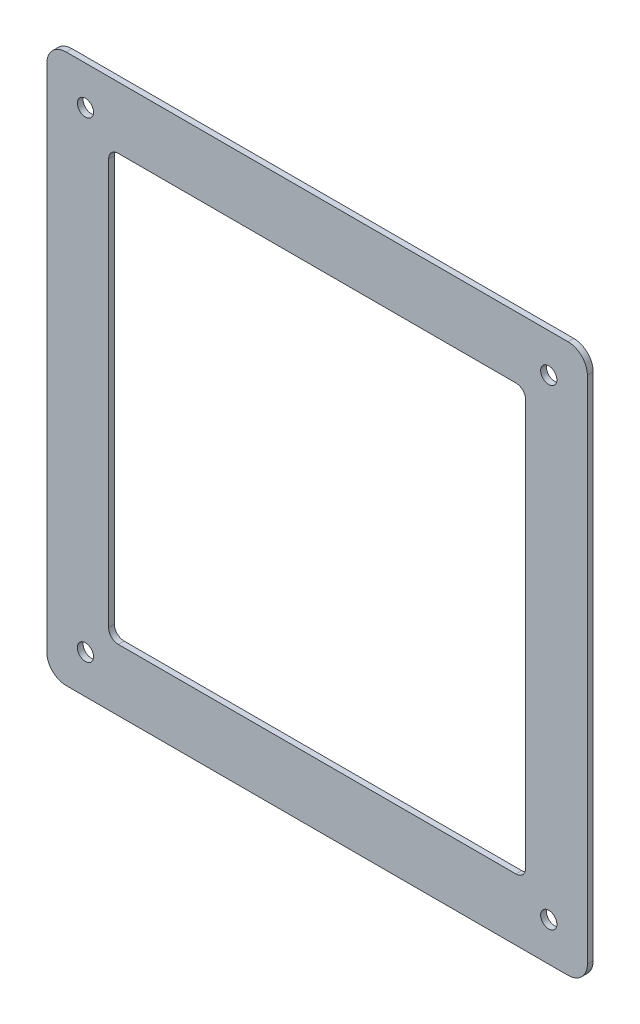
ISO-10303-21;
HEADER;
FILE_DESCRIPTION(('STEP AP214'),'2;1');
FILE_NAME('part.step','',(''),(''),'','','');
FILE_SCHEMA(('AUTOMOTIVE_DESIGN { 1 0 10303 214 1 1 1 1 }'));
ENDSEC;
DATA;
#1=APPLICATION_CONTEXT('core data for automotive mechanical design processes');
#2=APPLICATION_PROTOCOL_DEFINITION('international standard','automotive_design',2000,#1);
#3=PRODUCT_CONTEXT('',#1,'mechanical');
#4=PRODUCT('Part','Part','',(#3));
#5=PRODUCT_RELATED_PRODUCT_CATEGORY('part','',(#4));
#6=PRODUCT_DEFINITION_FORMATION('','',#4);
#7=PRODUCT_DEFINITION_CONTEXT('part definition',#1,'design');
#8=PRODUCT_DEFINITION('design','',#6,#7);
#9=PRODUCT_DEFINITION_SHAPE('','',#8);
#10=(LENGTH_UNIT() NAMED_UNIT(*) SI_UNIT(.MILLI.,.METRE.));
#11=(NAMED_UNIT(*) PLANE_ANGLE_UNIT() SI_UNIT($,.RADIAN.));
#12=(NAMED_UNIT(*) SI_UNIT($,.STERADIAN.) SOLID_ANGLE_UNIT());
#13=UNCERTAINTY_MEASURE_WITH_UNIT(LENGTH_MEASURE(1.E-05),#10,'distance_accuracy_value','');
#14=(GEOMETRIC_REPRESENTATION_CONTEXT(3) GLOBAL_UNCERTAINTY_ASSIGNED_CONTEXT((#13)) GLOBAL_UNIT_ASSIGNED_CONTEXT((#10,
#11,#12)) REPRESENTATION_CONTEXT('',''));
#15=CARTESIAN_POINT('',(0.,0.,0.));
#16=DIRECTION('',(0.,0.,1.));
#17=DIRECTION('',(1.,0.,0.));
#18=AXIS2_PLACEMENT_3D('',#15,#16,#17);
#19=CARTESIAN_POINT('',(0.,0.,3.));
#20=DIRECTION('',(0.,0.,-1.));
#21=DIRECTION('',(-1.,0.,0.));
#22=AXIS2_PLACEMENT_3D('',#19,#20,#21);
#23=PLANE('',#22);
#24=CARTESIAN_POINT('',(120.,-122.125,3.));
#25=DIRECTION('',(0.,0.,1.));
#26=DIRECTION('',(1.,0.,0.));
#27=AXIS2_PLACEMENT_3D('',#24,#25,#26);
#28=CIRCLE('',#27,4.2);
#29=CARTESIAN_POINT('',(124.2,-122.125,3.));
#30=VERTEX_POINT('',#29);
#31=EDGE_CURVE('E484',#30,#30,#28,.T.);
#32=ORIENTED_EDGE('',*,*,#31,.F.);
#33=EDGE_LOOP('',(#32));
#34=FACE_BOUND('',#33,.T.);
#35=CARTESIAN_POINT('',(-120.,122.125,3.));
#36=DIRECTION('',(0.,0.,1.));
#37=DIRECTION('',(1.,0.,0.));
#38=AXIS2_PLACEMENT_3D('',#35,#36,#37);
#39=CIRCLE('',#38,4.2);
#40=CARTESIAN_POINT('',(-115.8,122.125,3.));
#41=VERTEX_POINT('',#40);
#42=EDGE_CURVE('E486',#41,#41,#39,.T.);
#43=ORIENTED_EDGE('',*,*,#42,.F.);
#44=EDGE_LOOP('',(#43));
#45=FACE_BOUND('',#44,.T.);
#46=CARTESIAN_POINT('',(-120.,-122.125,3.));
#47=DIRECTION('',(0.,0.,1.));
#48=DIRECTION('',(1.,0.,0.));
#49=AXIS2_PLACEMENT_3D('',#46,#47,#48);
#50=CIRCLE('',#49,4.2);
#51=CARTESIAN_POINT('',(-115.8,-122.125,3.));
#52=VERTEX_POINT('',#51);
#53=EDGE_CURVE('E494',#52,#52,#50,.T.);
#54=ORIENTED_EDGE('',*,*,#53,.F.);
#55=EDGE_LOOP('',(#54));
#56=FACE_BOUND('',#55,.T.);
#57=CARTESIAN_POINT('',(120.,122.125,3.));
#58=DIRECTION('',(0.,0.,1.));
#59=DIRECTION('',(1.,0.,0.));
#60=AXIS2_PLACEMENT_3D('',#57,#58,#59);
#61=CIRCLE('',#60,4.2);
#62=CARTESIAN_POINT('',(124.2,122.125,3.));
#63=VERTEX_POINT('',#62);
#64=EDGE_CURVE('E499',#63,#63,#61,.T.);
#65=ORIENTED_EDGE('',*,*,#64,.F.);
#66=EDGE_LOOP('',(#65));
#67=FACE_BOUND('',#66,.T.);
#68=DIRECTION('',(0.,1.,0.));
#69=VECTOR('',#68,1.);
#70=CARTESIAN_POINT('',(140.,-142.125,3.));
#71=LINE('',#70,#69);
#72=CARTESIAN_POINT('',(140.,-132.125,3.));
#73=VERTEX_POINT('',#72);
#74=CARTESIAN_POINT('',(140.,132.125,3.));
#75=VERTEX_POINT('',#74);
#76=EDGE_CURVE('E186',#73,#75,#71,.T.);
#77=ORIENTED_EDGE('',*,*,#76,.T.);
#78=CARTESIAN_POINT('',(130.,132.125,3.));
#79=DIRECTION('',(0.,0.,-1.));
#80=DIRECTION('',(-1.,0.,0.));
#81=AXIS2_PLACEMENT_3D('',#78,#79,#80);
#82=CIRCLE('',#81,10.);
#83=CARTESIAN_POINT('',(130.,142.125,3.));
#84=VERTEX_POINT('',#83);
#85=EDGE_CURVE('E202',#75,#84,#82,.F.);
#86=ORIENTED_EDGE('',*,*,#85,.T.);
#87=DIRECTION('',(-1.,0.,0.));
#88=VECTOR('',#87,1.);
#89=CARTESIAN_POINT('',(-140.,142.125,3.));
#90=LINE('',#89,#88);
#91=CARTESIAN_POINT('',(-130.,142.125,3.));
#92=VERTEX_POINT('',#91);
#93=EDGE_CURVE('E167',#84,#92,#90,.T.);
#94=ORIENTED_EDGE('',*,*,#93,.T.);
#95=CARTESIAN_POINT('',(-130.,132.125,3.));
#96=DIRECTION('',(0.,0.,-1.));
#97=DIRECTION('',(-1.,0.,0.));
#98=AXIS2_PLACEMENT_3D('',#95,#96,#97);
#99=CIRCLE('',#98,10.);
#100=CARTESIAN_POINT('',(-140.,132.125,3.));
#101=VERTEX_POINT('',#100);
#102=EDGE_CURVE('E196',#92,#101,#99,.F.);
#103=ORIENTED_EDGE('',*,*,#102,.T.);
#104=DIRECTION('',(0.,-1.,0.));
#105=VECTOR('',#104,1.);
#106=CARTESIAN_POINT('',(-140.,-142.125,3.));
#107=LINE('',#106,#105);
#108=CARTESIAN_POINT('',(-140.,-132.125,3.));
#109=VERTEX_POINT('',#108);
#110=EDGE_CURVE('E282',#101,#109,#107,.T.);
#111=ORIENTED_EDGE('',*,*,#110,.T.);
#112=CARTESIAN_POINT('',(-130.,-132.125,3.));
#113=DIRECTION('',(0.,0.,-1.));
#114=DIRECTION('',(-1.,0.,0.));
#115=AXIS2_PLACEMENT_3D('',#112,#113,#114);
#116=CIRCLE('',#115,10.);
#117=CARTESIAN_POINT('',(-130.,-142.125,3.));
#118=VERTEX_POINT('',#117);
#119=EDGE_CURVE('E198',#109,#118,#116,.F.);
#120=ORIENTED_EDGE('',*,*,#119,.T.);
#121=DIRECTION('',(1.,0.,0.));
#122=VECTOR('',#121,1.);
#123=CARTESIAN_POINT('',(-140.,-142.125,3.));
#124=LINE('',#123,#122);
#125=CARTESIAN_POINT('',(130.,-142.125,3.));
#126=VERTEX_POINT('',#125);
#127=EDGE_CURVE('E187',#118,#126,#124,.T.);
#128=ORIENTED_EDGE('',*,*,#127,.T.);
#129=CARTESIAN_POINT('',(130.,-132.125,3.));
#130=DIRECTION('',(0.,0.,-1.));
#131=DIRECTION('',(-1.,0.,0.));
#132=AXIS2_PLACEMENT_3D('',#129,#130,#131);
#133=CIRCLE('',#132,10.);
#134=EDGE_CURVE('E200',#126,#73,#133,.F.);
#135=ORIENTED_EDGE('',*,*,#134,.T.);
#136=EDGE_LOOP('',(#77,#86,#94,#103,#111,#120,#128,#135));
#137=FACE_BOUND('',#136,.T.);
#138=DIRECTION('',(0.,1.,0.));
#139=VECTOR('',#138,1.);
#140=CARTESIAN_POINT('',(108.,-110.125,3.));
#141=LINE('',#140,#139);
#142=CARTESIAN_POINT('',(108.,-105.125,3.));
#143=VERTEX_POINT('',#142);
#144=CARTESIAN_POINT('',(108.,105.125,3.));
#145=VERTEX_POINT('',#144);
#146=EDGE_CURVE('E260',#143,#145,#141,.T.);
#147=ORIENTED_EDGE('',*,*,#146,.F.);
#148=CARTESIAN_POINT('',(103.,-105.125,3.));
#149=DIRECTION('',(0.,0.,-1.));
#150=DIRECTION('',(-1.,0.,0.));
#151=AXIS2_PLACEMENT_3D('',#148,#149,#150);
#152=CIRCLE('',#151,5.);
#153=CARTESIAN_POINT('',(103.,-110.125,3.));
#154=VERTEX_POINT('',#153);
#155=EDGE_CURVE('E243',#143,#154,#152,.T.);
#156=ORIENTED_EDGE('',*,*,#155,.T.);
#157=DIRECTION('',(1.,0.,0.));
#158=VECTOR('',#157,1.);
#159=CARTESIAN_POINT('',(-108.,-110.125,3.));
#160=LINE('',#159,#158);
#161=CARTESIAN_POINT('',(-103.,-110.125,3.));
#162=VERTEX_POINT('',#161);
#163=EDGE_CURVE('E180',#162,#154,#160,.T.);
#164=ORIENTED_EDGE('',*,*,#163,.F.);
#165=CARTESIAN_POINT('',(-103.,-105.125,3.));
#166=DIRECTION('',(0.,0.,-1.));
#167=DIRECTION('',(-1.,0.,0.));
#168=AXIS2_PLACEMENT_3D('',#165,#166,#167);
#169=CIRCLE('',#168,5.);
#170=CARTESIAN_POINT('',(-108.,-105.125,3.));
#171=VERTEX_POINT('',#170);
#172=EDGE_CURVE('E239',#162,#171,#169,.T.);
#173=ORIENTED_EDGE('',*,*,#172,.T.);
#174=DIRECTION('',(0.,-1.,0.));
#175=VECTOR('',#174,1.);
#176=CARTESIAN_POINT('',(-108.,-110.125,3.));
#177=LINE('',#176,#175);
#178=CARTESIAN_POINT('',(-108.,105.125,3.));
#179=VERTEX_POINT('',#178);
#180=EDGE_CURVE('E265',#179,#171,#177,.T.);
#181=ORIENTED_EDGE('',*,*,#180,.F.);
#182=CARTESIAN_POINT('',(-103.,105.125,3.));
#183=DIRECTION('',(0.,0.,-1.));
#184=DIRECTION('',(-1.,0.,0.));
#185=AXIS2_PLACEMENT_3D('',#182,#183,#184);
#186=CIRCLE('',#185,5.);
#187=CARTESIAN_POINT('',(-103.,110.125,3.));
#188=VERTEX_POINT('',#187);
#189=EDGE_CURVE('E235',#179,#188,#186,.T.);
#190=ORIENTED_EDGE('',*,*,#189,.T.);
#191=DIRECTION('',(-1.,0.,0.));
#192=VECTOR('',#191,1.);
#193=CARTESIAN_POINT('',(-108.,110.125,3.));
#194=LINE('',#193,#192);
#195=CARTESIAN_POINT('',(103.,110.125,3.));
#196=VERTEX_POINT('',#195);
#197=EDGE_CURVE('E262',#196,#188,#194,.T.);
#198=ORIENTED_EDGE('',*,*,#197,.F.);
#199=CARTESIAN_POINT('',(103.,105.125,3.));
#200=DIRECTION('',(0.,0.,-1.));
#201=DIRECTION('',(-1.,0.,0.));
#202=AXIS2_PLACEMENT_3D('',#199,#200,#201);
#203=CIRCLE('',#202,5.);
#204=EDGE_CURVE('E11',#196,#145,#203,.T.);
#205=ORIENTED_EDGE('',*,*,#204,.T.);
#206=EDGE_LOOP('',(#147,#156,#164,#173,#181,#190,#198,#205));
#207=FACE_BOUND('',#206,.T.);
#208=ADVANCED_FACE('F34',(#34,#45,#56,#67,#137,#207),#23,.F.);
#209=CARTESIAN_POINT('',(0.,0.,0.));
#210=DIRECTION('',(0.,0.,-1.));
#211=DIRECTION('',(-1.,0.,0.));
#212=AXIS2_PLACEMENT_3D('',#209,#210,#211);
#213=PLANE('',#212);
#214=CARTESIAN_POINT('',(120.,-122.125,0.));
#215=DIRECTION('',(0.,0.,1.));
#216=DIRECTION('',(1.,0.,0.));
#217=AXIS2_PLACEMENT_3D('',#214,#215,#216);
#218=CIRCLE('',#217,4.2);
#219=CARTESIAN_POINT('',(124.2,-122.125,0.));
#220=VERTEX_POINT('',#219);
#221=EDGE_CURVE('E482',#220,#220,#218,.T.);
#222=ORIENTED_EDGE('',*,*,#221,.T.);
#223=EDGE_LOOP('',(#222));
#224=FACE_BOUND('',#223,.T.);
#225=CARTESIAN_POINT('',(-120.,122.125,0.));
#226=DIRECTION('',(0.,0.,1.));
#227=DIRECTION('',(1.,0.,0.));
#228=AXIS2_PLACEMENT_3D('',#225,#226,#227);
#229=CIRCLE('',#228,4.2);
#230=CARTESIAN_POINT('',(-115.8,122.125,0.));
#231=VERTEX_POINT('',#230);
#232=EDGE_CURVE('E491',#231,#231,#229,.T.);
#233=ORIENTED_EDGE('',*,*,#232,.T.);
#234=EDGE_LOOP('',(#233));
#235=FACE_BOUND('',#234,.T.);
#236=CARTESIAN_POINT('',(-120.,-122.125,0.));
#237=DIRECTION('',(0.,0.,1.));
#238=DIRECTION('',(1.,0.,0.));
#239=AXIS2_PLACEMENT_3D('',#236,#237,#238);
#240=CIRCLE('',#239,4.2);
#241=CARTESIAN_POINT('',(-115.8,-122.125,0.));
#242=VERTEX_POINT('',#241);
#243=EDGE_CURVE('E497',#242,#242,#240,.T.);
#244=ORIENTED_EDGE('',*,*,#243,.T.);
#245=EDGE_LOOP('',(#244));
#246=FACE_BOUND('',#245,.T.);
#247=CARTESIAN_POINT('',(120.,122.125,0.));
#248=DIRECTION('',(0.,0.,1.));
#249=DIRECTION('',(1.,0.,0.));
#250=AXIS2_PLACEMENT_3D('',#247,#248,#249);
#251=CIRCLE('',#250,4.2);
#252=CARTESIAN_POINT('',(124.2,122.125,0.));
#253=VERTEX_POINT('',#252);
#254=EDGE_CURVE('E270',#253,#253,#251,.T.);
#255=ORIENTED_EDGE('',*,*,#254,.T.);
#256=EDGE_LOOP('',(#255));
#257=FACE_BOUND('',#256,.T.);
#258=DIRECTION('',(-1.,0.,0.));
#259=VECTOR('',#258,1.);
#260=CARTESIAN_POINT('',(-140.,142.125,0.));
#261=LINE('',#260,#259);
#262=CARTESIAN_POINT('',(130.,142.125,0.));
#263=VERTEX_POINT('',#262);
#264=CARTESIAN_POINT('',(-130.,142.125,0.));
#265=VERTEX_POINT('',#264);
#266=EDGE_CURVE('E164',#263,#265,#261,.T.);
#267=ORIENTED_EDGE('',*,*,#266,.F.);
#268=CARTESIAN_POINT('',(130.,132.125,0.));
#269=DIRECTION('',(0.,0.,-1.));
#270=DIRECTION('',(-1.,0.,0.));
#271=AXIS2_PLACEMENT_3D('',#268,#269,#270);
#272=CIRCLE('',#271,10.);
#273=CARTESIAN_POINT('',(140.,132.125,0.));
#274=VERTEX_POINT('',#273);
#275=EDGE_CURVE('E147',#263,#274,#272,.T.);
#276=ORIENTED_EDGE('',*,*,#275,.T.);
#277=DIRECTION('',(0.,1.,0.));
#278=VECTOR('',#277,1.);
#279=CARTESIAN_POINT('',(140.,-142.125,0.));
#280=LINE('',#279,#278);
#281=CARTESIAN_POINT('',(140.,-132.125,0.));
#282=VERTEX_POINT('',#281);
#283=EDGE_CURVE('E175',#282,#274,#280,.T.);
#284=ORIENTED_EDGE('',*,*,#283,.F.);
#285=CARTESIAN_POINT('',(130.,-132.125,0.));
#286=DIRECTION('',(0.,0.,-1.));
#287=DIRECTION('',(-1.,0.,0.));
#288=AXIS2_PLACEMENT_3D('',#285,#286,#287);
#289=CIRCLE('',#288,10.);
#290=CARTESIAN_POINT('',(130.,-142.125,0.));
#291=VERTEX_POINT('',#290);
#292=EDGE_CURVE('E158',#282,#291,#289,.T.);
#293=ORIENTED_EDGE('',*,*,#292,.T.);
#294=DIRECTION('',(1.,0.,0.));
#295=VECTOR('',#294,1.);
#296=CARTESIAN_POINT('',(-140.,-142.125,0.));
#297=LINE('',#296,#295);
#298=CARTESIAN_POINT('',(-130.,-142.125,0.));
#299=VERTEX_POINT('',#298);
#300=EDGE_CURVE('E178',#299,#291,#297,.T.);
#301=ORIENTED_EDGE('',*,*,#300,.F.);
#302=CARTESIAN_POINT('',(-130.,-132.125,0.));
#303=DIRECTION('',(0.,0.,-1.));
#304=DIRECTION('',(-1.,0.,0.));
#305=AXIS2_PLACEMENT_3D('',#302,#303,#304);
#306=CIRCLE('',#305,10.);
#307=CARTESIAN_POINT('',(-140.,-132.125,0.));
#308=VERTEX_POINT('',#307);
#309=EDGE_CURVE('E190',#299,#308,#306,.T.);
#310=ORIENTED_EDGE('',*,*,#309,.T.);
#311=DIRECTION('',(0.,-1.,0.));
#312=VECTOR('',#311,1.);
#313=CARTESIAN_POINT('',(-140.,-142.125,0.));
#314=LINE('',#313,#312);
#315=CARTESIAN_POINT('',(-140.,132.125,0.));
#316=VERTEX_POINT('',#315);
#317=EDGE_CURVE('E174',#316,#308,#314,.T.);
#318=ORIENTED_EDGE('',*,*,#317,.F.);
#319=CARTESIAN_POINT('',(-130.,132.125,0.));
#320=DIRECTION('',(0.,0.,-1.));
#321=DIRECTION('',(-1.,0.,0.));
#322=AXIS2_PLACEMENT_3D('',#319,#320,#321);
#323=CIRCLE('',#322,10.);
#324=EDGE_CURVE('E168',#316,#265,#323,.T.);
#325=ORIENTED_EDGE('',*,*,#324,.T.);
#326=EDGE_LOOP('',(#267,#276,#284,#293,#301,#310,#318,#325));
#327=FACE_BOUND('',#326,.T.);
#328=DIRECTION('',(0.,-1.,0.));
#329=VECTOR('',#328,1.);
#330=CARTESIAN_POINT('',(-108.,-110.125,0.));
#331=LINE('',#330,#329);
#332=CARTESIAN_POINT('',(-108.,105.125,0.));
#333=VERTEX_POINT('',#332);
#334=CARTESIAN_POINT('',(-108.,-105.125,0.));
#335=VERTEX_POINT('',#334);
#336=EDGE_CURVE('E257',#333,#335,#331,.T.);
#337=ORIENTED_EDGE('',*,*,#336,.T.);
#338=CARTESIAN_POINT('',(-103.,-105.125,0.));
#339=DIRECTION('',(0.,0.,-1.));
#340=DIRECTION('',(-1.,0.,0.));
#341=AXIS2_PLACEMENT_3D('',#338,#339,#340);
#342=CIRCLE('',#341,5.);
#343=CARTESIAN_POINT('',(-103.,-110.125,0.));
#344=VERTEX_POINT('',#343);
#345=EDGE_CURVE('E237',#335,#344,#342,.F.);
#346=ORIENTED_EDGE('',*,*,#345,.T.);
#347=DIRECTION('',(1.,0.,0.));
#348=VECTOR('',#347,1.);
#349=CARTESIAN_POINT('',(-108.,-110.125,0.));
#350=LINE('',#349,#348);
#351=CARTESIAN_POINT('',(103.,-110.125,0.));
#352=VERTEX_POINT('',#351);
#353=EDGE_CURVE('E263',#344,#352,#350,.T.);
#354=ORIENTED_EDGE('',*,*,#353,.T.);
#355=CARTESIAN_POINT('',(103.,-105.125,0.));
#356=DIRECTION('',(0.,0.,-1.));
#357=DIRECTION('',(-1.,0.,0.));
#358=AXIS2_PLACEMENT_3D('',#355,#356,#357);
#359=CIRCLE('',#358,5.);
#360=CARTESIAN_POINT('',(108.,-105.125,0.));
#361=VERTEX_POINT('',#360);
#362=EDGE_CURVE('E241',#352,#361,#359,.F.);
#363=ORIENTED_EDGE('',*,*,#362,.T.);
#364=DIRECTION('',(0.,1.,0.));
#365=VECTOR('',#364,1.);
#366=CARTESIAN_POINT('',(108.,-110.125,0.));
#367=LINE('',#366,#365);
#368=CARTESIAN_POINT('',(108.,105.125,0.));
#369=VERTEX_POINT('',#368);
#370=EDGE_CURVE('E249',#361,#369,#367,.T.);
#371=ORIENTED_EDGE('',*,*,#370,.T.);
#372=CARTESIAN_POINT('',(103.,105.125,0.));
#373=DIRECTION('',(0.,0.,-1.));
#374=DIRECTION('',(-1.,0.,0.));
#375=AXIS2_PLACEMENT_3D('',#372,#373,#374);
#376=CIRCLE('',#375,5.);
#377=CARTESIAN_POINT('',(103.,110.125,0.));
#378=VERTEX_POINT('',#377);
#379=EDGE_CURVE('E42',#369,#378,#376,.F.);
#380=ORIENTED_EDGE('',*,*,#379,.T.);
#381=DIRECTION('',(-1.,0.,0.));
#382=VECTOR('',#381,1.);
#383=CARTESIAN_POINT('',(-108.,110.125,0.));
#384=LINE('',#383,#382);
#385=CARTESIAN_POINT('',(-103.,110.125,0.));
#386=VERTEX_POINT('',#385);
#387=EDGE_CURVE('E248',#378,#386,#384,.T.);
#388=ORIENTED_EDGE('',*,*,#387,.T.);
#389=CARTESIAN_POINT('',(-103.,105.125,0.));
#390=DIRECTION('',(0.,0.,-1.));
#391=DIRECTION('',(-1.,0.,0.));
#392=AXIS2_PLACEMENT_3D('',#389,#390,#391);
#393=CIRCLE('',#392,5.);
#394=EDGE_CURVE('E233',#386,#333,#393,.F.);
#395=ORIENTED_EDGE('',*,*,#394,.T.);
#396=EDGE_LOOP('',(#337,#346,#354,#363,#371,#380,#388,#395));
#397=FACE_BOUND('',#396,.T.);
#398=ADVANCED_FACE('F171',(#224,#235,#246,#257,#327,#397),#213,.T.);
#399=CARTESIAN_POINT('',(140.,-142.125,3.));
#400=DIRECTION('',(-1.,0.,0.));
#401=DIRECTION('',(0.,0.,1.));
#402=AXIS2_PLACEMENT_3D('',#399,#400,#401);
#403=PLANE('',#402);
#404=ORIENTED_EDGE('',*,*,#283,.T.);
#405=DIRECTION('',(0.,0.,-1.));
#406=VECTOR('',#405,1.);
#407=CARTESIAN_POINT('',(140.,132.125,3.));
#408=LINE('',#407,#406);
#409=EDGE_CURVE('E152',#274,#75,#408,.F.);
#410=ORIENTED_EDGE('',*,*,#409,.T.);
#411=ORIENTED_EDGE('',*,*,#76,.F.);
#412=DIRECTION('',(0.,0.,-1.));
#413=VECTOR('',#412,1.);
#414=CARTESIAN_POINT('',(140.,-132.125,3.));
#415=LINE('',#414,#413);
#416=EDGE_CURVE('E157',#73,#282,#415,.T.);
#417=ORIENTED_EDGE('',*,*,#416,.T.);
#418=EDGE_LOOP('',(#404,#410,#411,#417));
#419=FACE_BOUND('',#418,.T.);
#420=ADVANCED_FACE('F297',(#419),#403,.F.);
#421=CARTESIAN_POINT('',(-140.,142.125,3.));
#422=DIRECTION('',(0.,-1.,0.));
#423=DIRECTION('',(0.,0.,-1.));
#424=AXIS2_PLACEMENT_3D('',#421,#422,#423);
#425=PLANE('',#424);
#426=ORIENTED_EDGE('',*,*,#93,.F.);
#427=DIRECTION('',(0.,0.,-1.));
#428=VECTOR('',#427,1.);
#429=CARTESIAN_POINT('',(130.,142.125,3.));
#430=LINE('',#429,#428);
#431=EDGE_CURVE('E151',#84,#263,#430,.T.);
#432=ORIENTED_EDGE('',*,*,#431,.T.);
#433=ORIENTED_EDGE('',*,*,#266,.T.);
#434=DIRECTION('',(0.,0.,-1.));
#435=VECTOR('',#434,1.);
#436=CARTESIAN_POINT('',(-130.,142.125,3.));
#437=LINE('',#436,#435);
#438=EDGE_CURVE('E169',#265,#92,#437,.F.);
#439=ORIENTED_EDGE('',*,*,#438,.T.);
#440=EDGE_LOOP('',(#426,#432,#433,#439));
#441=FACE_BOUND('',#440,.T.);
#442=ADVANCED_FACE('F163',(#441),#425,.F.);
#443=CARTESIAN_POINT('',(-140.,-142.125,3.));
#444=DIRECTION('',(1.,0.,0.));
#445=DIRECTION('',(0.,0.,-1.));
#446=AXIS2_PLACEMENT_3D('',#443,#444,#445);
#447=PLANE('',#446);
#448=ORIENTED_EDGE('',*,*,#317,.T.);
#449=DIRECTION('',(0.,0.,-1.));
#450=VECTOR('',#449,1.);
#451=CARTESIAN_POINT('',(-140.,-132.125,3.));
#452=LINE('',#451,#450);
#453=EDGE_CURVE('E212',#308,#109,#452,.F.);
#454=ORIENTED_EDGE('',*,*,#453,.T.);
#455=ORIENTED_EDGE('',*,*,#110,.F.);
#456=DIRECTION('',(0.,0.,-1.));
#457=VECTOR('',#456,1.);
#458=CARTESIAN_POINT('',(-140.,132.125,3.));
#459=LINE('',#458,#457);
#460=EDGE_CURVE('E209',#101,#316,#459,.T.);
#461=ORIENTED_EDGE('',*,*,#460,.T.);
#462=EDGE_LOOP('',(#448,#454,#455,#461));
#463=FACE_BOUND('',#462,.T.);
#464=ADVANCED_FACE('F304',(#463),#447,.F.);
#465=CARTESIAN_POINT('',(-140.,-142.125,3.));
#466=DIRECTION('',(0.,1.,0.));
#467=DIRECTION('',(0.,0.,1.));
#468=AXIS2_PLACEMENT_3D('',#465,#466,#467);
#469=PLANE('',#468);
#470=ORIENTED_EDGE('',*,*,#300,.T.);
#471=DIRECTION('',(0.,0.,-1.));
#472=VECTOR('',#471,1.);
#473=CARTESIAN_POINT('',(130.,-142.125,3.));
#474=LINE('',#473,#472);
#475=EDGE_CURVE('E207',#291,#126,#474,.F.);
#476=ORIENTED_EDGE('',*,*,#475,.T.);
#477=ORIENTED_EDGE('',*,*,#127,.F.);
#478=DIRECTION('',(0.,0.,-1.));
#479=VECTOR('',#478,1.);
#480=CARTESIAN_POINT('',(-130.,-142.125,3.));
#481=LINE('',#480,#479);
#482=EDGE_CURVE('E204',#118,#299,#481,.T.);
#483=ORIENTED_EDGE('',*,*,#482,.T.);
#484=EDGE_LOOP('',(#470,#476,#477,#483));
#485=FACE_BOUND('',#484,.T.);
#486=ADVANCED_FACE('F299',(#485),#469,.F.);
#487=CARTESIAN_POINT('',(108.,-110.125,3.));
#488=DIRECTION('',(-1.,0.,0.));
#489=DIRECTION('',(0.,0.,1.));
#490=AXIS2_PLACEMENT_3D('',#487,#488,#489);
#491=PLANE('',#490);
#492=ORIENTED_EDGE('',*,*,#370,.F.);
#493=DIRECTION('',(0.,0.,-1.));
#494=VECTOR('',#493,1.);
#495=CARTESIAN_POINT('',(108.,-105.125,3.));
#496=LINE('',#495,#494);
#497=EDGE_CURVE('E54',#361,#143,#496,.F.);
#498=ORIENTED_EDGE('',*,*,#497,.T.);
#499=ORIENTED_EDGE('',*,*,#146,.T.);
#500=DIRECTION('',(0.,0.,-1.));
#501=VECTOR('',#500,1.);
#502=CARTESIAN_POINT('',(108.,105.125,0.));
#503=LINE('',#502,#501);
#504=EDGE_CURVE('E229',#145,#369,#503,.T.);
#505=ORIENTED_EDGE('',*,*,#504,.T.);
#506=EDGE_LOOP('',(#492,#498,#499,#505));
#507=FACE_BOUND('',#506,.T.);
#508=ADVANCED_FACE('F259',(#507),#491,.T.);
#509=CARTESIAN_POINT('',(-108.,110.125,3.));
#510=DIRECTION('',(0.,-1.,0.));
#511=DIRECTION('',(0.,0.,-1.));
#512=AXIS2_PLACEMENT_3D('',#509,#510,#511);
#513=PLANE('',#512);
#514=ORIENTED_EDGE('',*,*,#197,.T.);
#515=DIRECTION('',(0.,0.,-1.));
#516=VECTOR('',#515,1.);
#517=CARTESIAN_POINT('',(-103.,110.125,0.));
#518=LINE('',#517,#516);
#519=EDGE_CURVE('E216',#188,#386,#518,.T.);
#520=ORIENTED_EDGE('',*,*,#519,.T.);
#521=ORIENTED_EDGE('',*,*,#387,.F.);
#522=DIRECTION('',(0.,0.,-1.));
#523=VECTOR('',#522,1.);
#524=CARTESIAN_POINT('',(103.,110.125,3.));
#525=LINE('',#524,#523);
#526=EDGE_CURVE('E214',#378,#196,#525,.F.);
#527=ORIENTED_EDGE('',*,*,#526,.T.);
#528=EDGE_LOOP('',(#514,#520,#521,#527));
#529=FACE_BOUND('',#528,.T.);
#530=ADVANCED_FACE('F255',(#529),#513,.T.);
#531=CARTESIAN_POINT('',(-108.,-110.125,3.));
#532=DIRECTION('',(1.,0.,0.));
#533=DIRECTION('',(0.,0.,-1.));
#534=AXIS2_PLACEMENT_3D('',#531,#532,#533);
#535=PLANE('',#534);
#536=ORIENTED_EDGE('',*,*,#336,.F.);
#537=DIRECTION('',(0.,0.,-1.));
#538=VECTOR('',#537,1.);
#539=CARTESIAN_POINT('',(-108.,105.125,3.));
#540=LINE('',#539,#538);
#541=EDGE_CURVE('E222',#333,#179,#540,.F.);
#542=ORIENTED_EDGE('',*,*,#541,.T.);
#543=ORIENTED_EDGE('',*,*,#180,.T.);
#544=DIRECTION('',(0.,0.,-1.));
#545=VECTOR('',#544,1.);
#546=CARTESIAN_POINT('',(-108.,-105.125,0.));
#547=LINE('',#546,#545);
#548=EDGE_CURVE('E219',#171,#335,#547,.T.);
#549=ORIENTED_EDGE('',*,*,#548,.T.);
#550=EDGE_LOOP('',(#536,#542,#543,#549));
#551=FACE_BOUND('',#550,.T.);
#552=ADVANCED_FACE('F377',(#551),#535,.T.);
#553=CARTESIAN_POINT('',(-108.,-110.125,3.));
#554=DIRECTION('',(0.,1.,0.));
#555=DIRECTION('',(0.,0.,1.));
#556=AXIS2_PLACEMENT_3D('',#553,#554,#555);
#557=PLANE('',#556);
#558=ORIENTED_EDGE('',*,*,#353,.F.);
#559=DIRECTION('',(0.,0.,-1.));
#560=VECTOR('',#559,1.);
#561=CARTESIAN_POINT('',(-103.,-110.125,3.));
#562=LINE('',#561,#560);
#563=EDGE_CURVE('E227',#344,#162,#562,.F.);
#564=ORIENTED_EDGE('',*,*,#563,.T.);
#565=ORIENTED_EDGE('',*,*,#163,.T.);
#566=DIRECTION('',(0.,0.,-1.));
#567=VECTOR('',#566,1.);
#568=CARTESIAN_POINT('',(103.,-110.125,0.));
#569=LINE('',#568,#567);
#570=EDGE_CURVE('E224',#154,#352,#569,.T.);
#571=ORIENTED_EDGE('',*,*,#570,.T.);
#572=EDGE_LOOP('',(#558,#564,#565,#571));
#573=FACE_BOUND('',#572,.T.);
#574=ADVANCED_FACE('F344',(#573),#557,.T.);
#575=CARTESIAN_POINT('',(130.,132.125,3.));
#576=DIRECTION('',(0.,0.,-1.));
#577=DIRECTION('',(-1.,0.,0.));
#578=AXIS2_PLACEMENT_3D('',#575,#576,#577);
#579=CYLINDRICAL_SURFACE('',#578,10.);
#580=ORIENTED_EDGE('',*,*,#85,.F.);
#581=ORIENTED_EDGE('',*,*,#409,.F.);
#582=ORIENTED_EDGE('',*,*,#275,.F.);
#583=ORIENTED_EDGE('',*,*,#431,.F.);
#584=EDGE_LOOP('',(#580,#581,#582,#583));
#585=FACE_BOUND('',#584,.T.);
#586=ADVANCED_FACE('F150',(#585),#579,.T.);
#587=CARTESIAN_POINT('',(130.,-132.125,3.));
#588=DIRECTION('',(0.,0.,-1.));
#589=DIRECTION('',(-1.,0.,0.));
#590=AXIS2_PLACEMENT_3D('',#587,#588,#589);
#591=CYLINDRICAL_SURFACE('',#590,10.);
#592=ORIENTED_EDGE('',*,*,#134,.F.);
#593=ORIENTED_EDGE('',*,*,#475,.F.);
#594=ORIENTED_EDGE('',*,*,#292,.F.);
#595=ORIENTED_EDGE('',*,*,#416,.F.);
#596=EDGE_LOOP('',(#592,#593,#594,#595));
#597=FACE_BOUND('',#596,.T.);
#598=ADVANCED_FACE('F295',(#597),#591,.T.);
#599=CARTESIAN_POINT('',(-130.,-132.125,3.));
#600=DIRECTION('',(0.,0.,-1.));
#601=DIRECTION('',(-1.,0.,0.));
#602=AXIS2_PLACEMENT_3D('',#599,#600,#601);
#603=CYLINDRICAL_SURFACE('',#602,10.);
#604=ORIENTED_EDGE('',*,*,#119,.F.);
#605=ORIENTED_EDGE('',*,*,#453,.F.);
#606=ORIENTED_EDGE('',*,*,#309,.F.);
#607=ORIENTED_EDGE('',*,*,#482,.F.);
#608=EDGE_LOOP('',(#604,#605,#606,#607));
#609=FACE_BOUND('',#608,.T.);
#610=ADVANCED_FACE('F301',(#609),#603,.T.);
#611=CARTESIAN_POINT('',(-130.,132.125,3.));
#612=DIRECTION('',(0.,0.,-1.));
#613=DIRECTION('',(-1.,0.,0.));
#614=AXIS2_PLACEMENT_3D('',#611,#612,#613);
#615=CYLINDRICAL_SURFACE('',#614,10.);
#616=ORIENTED_EDGE('',*,*,#102,.F.);
#617=ORIENTED_EDGE('',*,*,#438,.F.);
#618=ORIENTED_EDGE('',*,*,#324,.F.);
#619=ORIENTED_EDGE('',*,*,#460,.F.);
#620=EDGE_LOOP('',(#616,#617,#618,#619));
#621=FACE_BOUND('',#620,.T.);
#622=ADVANCED_FACE('F309',(#621),#615,.T.);
#623=CARTESIAN_POINT('',(-103.,105.125,3.));
#624=DIRECTION('',(0.,0.,1.));
#625=DIRECTION('',(1.,0.,0.));
#626=AXIS2_PLACEMENT_3D('',#623,#624,#625);
#627=CYLINDRICAL_SURFACE('',#626,5.);
#628=ORIENTED_EDGE('',*,*,#189,.F.);
#629=ORIENTED_EDGE('',*,*,#541,.F.);
#630=ORIENTED_EDGE('',*,*,#394,.F.);
#631=ORIENTED_EDGE('',*,*,#519,.F.);
#632=EDGE_LOOP('',(#628,#629,#630,#631));
#633=FACE_BOUND('',#632,.T.);
#634=ADVANCED_FACE('F311',(#633),#627,.F.);
#635=CARTESIAN_POINT('',(-103.,-105.125,3.));
#636=DIRECTION('',(0.,0.,1.));
#637=DIRECTION('',(1.,0.,0.));
#638=AXIS2_PLACEMENT_3D('',#635,#636,#637);
#639=CYLINDRICAL_SURFACE('',#638,5.);
#640=ORIENTED_EDGE('',*,*,#172,.F.);
#641=ORIENTED_EDGE('',*,*,#563,.F.);
#642=ORIENTED_EDGE('',*,*,#345,.F.);
#643=ORIENTED_EDGE('',*,*,#548,.F.);
#644=EDGE_LOOP('',(#640,#641,#642,#643));
#645=FACE_BOUND('',#644,.T.);
#646=ADVANCED_FACE('F317',(#645),#639,.F.);
#647=CARTESIAN_POINT('',(103.,-105.125,3.));
#648=DIRECTION('',(0.,0.,1.));
#649=DIRECTION('',(1.,0.,0.));
#650=AXIS2_PLACEMENT_3D('',#647,#648,#649);
#651=CYLINDRICAL_SURFACE('',#650,5.);
#652=ORIENTED_EDGE('',*,*,#155,.F.);
#653=ORIENTED_EDGE('',*,*,#497,.F.);
#654=ORIENTED_EDGE('',*,*,#362,.F.);
#655=ORIENTED_EDGE('',*,*,#570,.F.);
#656=EDGE_LOOP('',(#652,#653,#654,#655));
#657=FACE_BOUND('',#656,.T.);
#658=ADVANCED_FACE('F408',(#657),#651,.F.);
#659=CARTESIAN_POINT('',(103.,105.125,3.));
#660=DIRECTION('',(0.,0.,1.));
#661=DIRECTION('',(1.,0.,0.));
#662=AXIS2_PLACEMENT_3D('',#659,#660,#661);
#663=CYLINDRICAL_SURFACE('',#662,5.);
#664=ORIENTED_EDGE('',*,*,#204,.F.);
#665=ORIENTED_EDGE('',*,*,#526,.F.);
#666=ORIENTED_EDGE('',*,*,#379,.F.);
#667=ORIENTED_EDGE('',*,*,#504,.F.);
#668=EDGE_LOOP('',(#664,#665,#666,#667));
#669=FACE_BOUND('',#668,.T.);
#670=ADVANCED_FACE('F36',(#669),#663,.F.);
#671=CARTESIAN_POINT('',(120.,122.125,3.));
#672=DIRECTION('',(0.,0.,1.));
#673=DIRECTION('',(1.,0.,0.));
#674=AXIS2_PLACEMENT_3D('',#671,#672,#673);
#675=CYLINDRICAL_SURFACE('',#674,4.2);
#676=ORIENTED_EDGE('',*,*,#254,.F.);
#677=EDGE_LOOP('',(#676));
#678=FACE_BOUND('',#677,.T.);
#679=ORIENTED_EDGE('',*,*,#64,.T.);
#680=EDGE_LOOP('',(#679));
#681=FACE_BOUND('',#680,.T.);
#682=ADVANCED_FACE('F425',(#678,#681),#675,.F.);
#683=CARTESIAN_POINT('',(-120.,-122.125,3.));
#684=DIRECTION('',(0.,0.,1.));
#685=DIRECTION('',(1.,0.,0.));
#686=AXIS2_PLACEMENT_3D('',#683,#684,#685);
#687=CYLINDRICAL_SURFACE('',#686,4.2);
#688=ORIENTED_EDGE('',*,*,#243,.F.);
#689=EDGE_LOOP('',(#688));
#690=FACE_BOUND('',#689,.T.);
#691=ORIENTED_EDGE('',*,*,#53,.T.);
#692=EDGE_LOOP('',(#691));
#693=FACE_BOUND('',#692,.T.);
#694=ADVANCED_FACE('F445',(#690,#693),#687,.F.);
#695=CARTESIAN_POINT('',(-120.,122.125,3.));
#696=DIRECTION('',(0.,0.,1.));
#697=DIRECTION('',(1.,0.,0.));
#698=AXIS2_PLACEMENT_3D('',#695,#696,#697);
#699=CYLINDRICAL_SURFACE('',#698,4.2);
#700=ORIENTED_EDGE('',*,*,#232,.F.);
#701=EDGE_LOOP('',(#700));
#702=FACE_BOUND('',#701,.T.);
#703=ORIENTED_EDGE('',*,*,#42,.T.);
#704=EDGE_LOOP('',(#703));
#705=FACE_BOUND('',#704,.T.);
#706=ADVANCED_FACE('F455',(#702,#705),#699,.F.);
#707=CARTESIAN_POINT('',(120.,-122.125,3.));
#708=DIRECTION('',(0.,0.,1.));
#709=DIRECTION('',(1.,0.,0.));
#710=AXIS2_PLACEMENT_3D('',#707,#708,#709);
#711=CYLINDRICAL_SURFACE('',#710,4.2);
#712=ORIENTED_EDGE('',*,*,#221,.F.);
#713=EDGE_LOOP('',(#712));
#714=FACE_BOUND('',#713,.T.);
#715=ORIENTED_EDGE('',*,*,#31,.T.);
#716=EDGE_LOOP('',(#715));
#717=FACE_BOUND('',#716,.T.);
#718=ADVANCED_FACE('F465',(#714,#717),#711,.F.);
#719=CLOSED_SHELL('',(#208,#398,#420,#442,#464,#486,#508,#530,#552,#574,#586,#598,#610,#622,
#634,#646,#658,#670,#682,#694,#706,#718));
#720=MANIFOLD_SOLID_BREP('B2',#719);
#721=ADVANCED_BREP_SHAPE_REPRESENTATION('',(#18,#720),#14);
#722=SHAPE_DEFINITION_REPRESENTATION(#9,#721);
ENDSEC;
END-ISO-10303-21;
